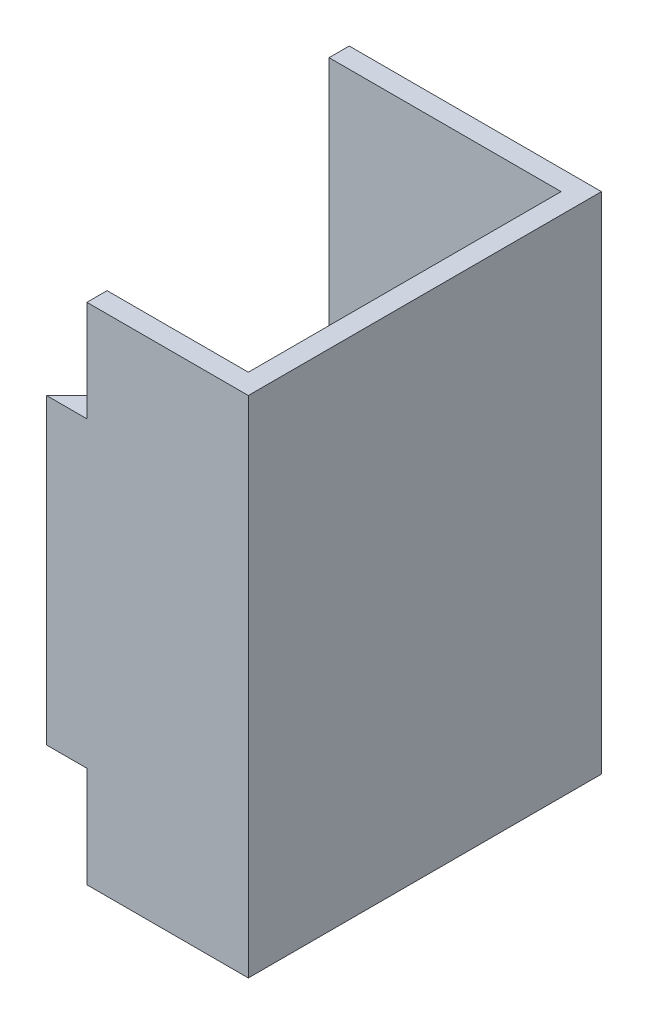
ISO-10303-21;
HEADER;
FILE_DESCRIPTION(('STEP AP214'),'2;1');
FILE_NAME('part.step','',(''),(''),'','','');
FILE_SCHEMA(('AUTOMOTIVE_DESIGN { 1 0 10303 214 1 1 1 1 }'));
ENDSEC;
DATA;
#1=APPLICATION_CONTEXT('core data for automotive mechanical design processes');
#2=APPLICATION_PROTOCOL_DEFINITION('international standard','automotive_design',2000,#1);
#3=PRODUCT_CONTEXT('',#1,'mechanical');
#4=PRODUCT('Part','Part','',(#3));
#5=PRODUCT_RELATED_PRODUCT_CATEGORY('part','',(#4));
#6=PRODUCT_DEFINITION_FORMATION('','',#4);
#7=PRODUCT_DEFINITION_CONTEXT('part definition',#1,'design');
#8=PRODUCT_DEFINITION('design','',#6,#7);
#9=PRODUCT_DEFINITION_SHAPE('','',#8);
#10=(LENGTH_UNIT() NAMED_UNIT(*) SI_UNIT(.MILLI.,.METRE.));
#11=(NAMED_UNIT(*) PLANE_ANGLE_UNIT() SI_UNIT($,.RADIAN.));
#12=(NAMED_UNIT(*) SI_UNIT($,.STERADIAN.) SOLID_ANGLE_UNIT());
#13=UNCERTAINTY_MEASURE_WITH_UNIT(LENGTH_MEASURE(1.E-05),#10,'distance_accuracy_value','');
#14=(GEOMETRIC_REPRESENTATION_CONTEXT(3) GLOBAL_UNCERTAINTY_ASSIGNED_CONTEXT((#13)) GLOBAL_UNIT_ASSIGNED_CONTEXT((#10,
#11,#12)) REPRESENTATION_CONTEXT('',''));
#15=CARTESIAN_POINT('',(0.,0.,0.));
#16=DIRECTION('',(0.,0.,1.));
#17=DIRECTION('',(1.,0.,0.));
#18=AXIS2_PLACEMENT_3D('',#15,#16,#17);
#19=CARTESIAN_POINT('',(0.48,-0.25,0.0199999999999999));
#20=DIRECTION('',(0.,0.,1.));
#21=DIRECTION('',(1.,0.,0.));
#22=AXIS2_PLACEMENT_3D('',#19,#20,#21);
#23=PLANE('',#22);
#24=DIRECTION('',(0.,1.,0.));
#25=VECTOR('',#24,1.);
#26=CARTESIAN_POINT('',(0.48,-0.25,0.0199999999999999));
#27=LINE('',#26,#25);
#28=CARTESIAN_POINT('',(0.48,-0.25,0.0199999999999999));
#29=VERTEX_POINT('',#28);
#30=CARTESIAN_POINT('',(0.48,0.25,0.0199999999999999));
#31=VERTEX_POINT('',#30);
#32=EDGE_CURVE('E11',#29,#31,#27,.T.);
#33=ORIENTED_EDGE('',*,*,#32,.T.);
#34=DIRECTION('',(1.,0.,0.));
#35=VECTOR('',#34,1.);
#36=CARTESIAN_POINT('',(0.48,0.25,0.0199999999999999));
#37=LINE('',#36,#35);
#38=CARTESIAN_POINT('',(0.25,0.25,0.02));
#39=VERTEX_POINT('',#38);
#40=EDGE_CURVE('E24',#39,#31,#37,.T.);
#41=ORIENTED_EDGE('',*,*,#40,.F.);
#42=DIRECTION('',(0.,1.,0.));
#43=VECTOR('',#42,1.);
#44=CARTESIAN_POINT('',(0.25,-0.25,0.02));
#45=LINE('',#44,#43);
#46=CARTESIAN_POINT('',(0.25,-0.25,0.02));
#47=VERTEX_POINT('',#46);
#48=EDGE_CURVE('E203',#47,#39,#45,.T.);
#49=ORIENTED_EDGE('',*,*,#48,.F.);
#50=DIRECTION('',(1.,0.,0.));
#51=VECTOR('',#50,1.);
#52=CARTESIAN_POINT('',(0.48,-0.25,0.0199999999999999));
#53=LINE('',#52,#51);
#54=EDGE_CURVE('E201',#47,#29,#53,.T.);
#55=ORIENTED_EDGE('',*,*,#54,.T.);
#56=EDGE_LOOP('',(#33,#41,#49,#55));
#57=FACE_BOUND('',#56,.T.);
#58=ADVANCED_FACE('F17',(#57),#23,.T.);
#59=CARTESIAN_POINT('',(0.25,-0.25,0.02));
#60=DIRECTION('',(-1.,0.,0.));
#61=DIRECTION('',(0.,0.,1.));
#62=AXIS2_PLACEMENT_3D('',#59,#60,#61);
#63=PLANE('',#62);
#64=ORIENTED_EDGE('',*,*,#48,.T.);
#65=DIRECTION('',(0.,0.,1.));
#66=VECTOR('',#65,1.);
#67=CARTESIAN_POINT('',(0.25,0.25,0.02));
#68=LINE('',#67,#66);
#69=CARTESIAN_POINT('',(0.25,0.25,0.));
#70=VERTEX_POINT('',#69);
#71=EDGE_CURVE('E198',#70,#39,#68,.T.);
#72=ORIENTED_EDGE('',*,*,#71,.F.);
#73=DIRECTION('',(0.,1.,0.));
#74=VECTOR('',#73,1.);
#75=CARTESIAN_POINT('',(0.25,-0.25,0.));
#76=LINE('',#75,#74);
#77=CARTESIAN_POINT('',(0.25,-0.25,0.));
#78=VERTEX_POINT('',#77);
#79=EDGE_CURVE('E195',#78,#70,#76,.T.);
#80=ORIENTED_EDGE('',*,*,#79,.F.);
#81=DIRECTION('',(0.,0.,1.));
#82=VECTOR('',#81,1.);
#83=CARTESIAN_POINT('',(0.25,-0.25,0.02));
#84=LINE('',#83,#82);
#85=EDGE_CURVE('E192',#78,#47,#84,.T.);
#86=ORIENTED_EDGE('',*,*,#85,.T.);
#87=EDGE_LOOP('',(#64,#72,#80,#86));
#88=FACE_BOUND('',#87,.T.);
#89=ADVANCED_FACE('F235',(#88),#63,.T.);
#90=CARTESIAN_POINT('',(0.25,-0.25,0.));
#91=DIRECTION('',(0.,0.,-1.));
#92=DIRECTION('',(-1.,0.,0.));
#93=AXIS2_PLACEMENT_3D('',#90,#91,#92);
#94=PLANE('',#93);
#95=ORIENTED_EDGE('',*,*,#79,.T.);
#96=DIRECTION('',(-1.,0.,0.));
#97=VECTOR('',#96,1.);
#98=CARTESIAN_POINT('',(0.25,0.25,0.));
#99=LINE('',#98,#97);
#100=CARTESIAN_POINT('',(0.5,0.25,0.));
#101=VERTEX_POINT('',#100);
#102=EDGE_CURVE('E189',#101,#70,#99,.T.);
#103=ORIENTED_EDGE('',*,*,#102,.F.);
#104=DIRECTION('',(0.,1.,0.));
#105=VECTOR('',#104,1.);
#106=CARTESIAN_POINT('',(0.5,-0.25,0.));
#107=LINE('',#106,#105);
#108=CARTESIAN_POINT('',(0.5,-0.25,0.));
#109=VERTEX_POINT('',#108);
#110=EDGE_CURVE('E186',#109,#101,#107,.T.);
#111=ORIENTED_EDGE('',*,*,#110,.F.);
#112=DIRECTION('',(-1.,0.,0.));
#113=VECTOR('',#112,1.);
#114=CARTESIAN_POINT('',(0.25,-0.25,0.));
#115=LINE('',#114,#113);
#116=EDGE_CURVE('E183',#109,#78,#115,.T.);
#117=ORIENTED_EDGE('',*,*,#116,.T.);
#118=EDGE_LOOP('',(#95,#103,#111,#117));
#119=FACE_BOUND('',#118,.T.);
#120=ADVANCED_FACE('F232',(#119),#94,.T.);
#121=CARTESIAN_POINT('',(0.5,-0.25,0.));
#122=DIRECTION('',(1.,0.,0.));
#123=DIRECTION('',(0.,0.,-1.));
#124=AXIS2_PLACEMENT_3D('',#121,#122,#123);
#125=PLANE('',#124);
#126=ORIENTED_EDGE('',*,*,#110,.T.);
#127=DIRECTION('',(0.,0.,-1.));
#128=VECTOR('',#127,1.);
#129=CARTESIAN_POINT('',(0.5,0.25,0.));
#130=LINE('',#129,#128);
#131=CARTESIAN_POINT('',(0.5,0.25,0.35));
#132=VERTEX_POINT('',#131);
#133=EDGE_CURVE('E180',#132,#101,#130,.T.);
#134=ORIENTED_EDGE('',*,*,#133,.F.);
#135=DIRECTION('',(0.,1.,0.));
#136=VECTOR('',#135,1.);
#137=CARTESIAN_POINT('',(0.5,-0.25,0.35));
#138=LINE('',#137,#136);
#139=CARTESIAN_POINT('',(0.5,-0.25,0.35));
#140=VERTEX_POINT('',#139);
#141=EDGE_CURVE('E177',#140,#132,#138,.T.);
#142=ORIENTED_EDGE('',*,*,#141,.F.);
#143=DIRECTION('',(0.,0.,-1.));
#144=VECTOR('',#143,1.);
#145=CARTESIAN_POINT('',(0.5,-0.25,0.));
#146=LINE('',#145,#144);
#147=EDGE_CURVE('E174',#140,#109,#146,.T.);
#148=ORIENTED_EDGE('',*,*,#147,.T.);
#149=EDGE_LOOP('',(#126,#134,#142,#148));
#150=FACE_BOUND('',#149,.T.);
#151=ADVANCED_FACE('F230',(#150),#125,.T.);
#152=CARTESIAN_POINT('',(0.5,-0.25,0.35));
#153=DIRECTION('',(0.,0.,1.));
#154=DIRECTION('',(1.,0.,0.));
#155=AXIS2_PLACEMENT_3D('',#152,#153,#154);
#156=PLANE('',#155);
#157=DIRECTION('',(1.,0.,0.));
#158=VECTOR('',#157,1.);
#159=CARTESIAN_POINT('',(0.34,0.15,0.35));
#160=LINE('',#159,#158);
#161=CARTESIAN_POINT('',(0.3,0.15,0.35));
#162=VERTEX_POINT('',#161);
#163=CARTESIAN_POINT('',(0.34,0.15,0.35));
#164=VERTEX_POINT('',#163);
#165=EDGE_CURVE('E172',#162,#164,#160,.T.);
#166=ORIENTED_EDGE('',*,*,#165,.F.);
#167=DIRECTION('',(0.,1.,0.));
#168=VECTOR('',#167,1.);
#169=CARTESIAN_POINT('',(0.3,-0.25,0.35));
#170=LINE('',#169,#168);
#171=CARTESIAN_POINT('',(0.3,-0.15,0.35));
#172=VERTEX_POINT('',#171);
#173=EDGE_CURVE('E169',#172,#162,#170,.T.);
#174=ORIENTED_EDGE('',*,*,#173,.F.);
#175=DIRECTION('',(-1.,0.,0.));
#176=VECTOR('',#175,1.);
#177=CARTESIAN_POINT('',(0.34,-0.15,0.35));
#178=LINE('',#177,#176);
#179=CARTESIAN_POINT('',(0.34,-0.15,0.35));
#180=VERTEX_POINT('',#179);
#181=EDGE_CURVE('E167',#180,#172,#178,.T.);
#182=ORIENTED_EDGE('',*,*,#181,.F.);
#183=DIRECTION('',(0.,1.,0.));
#184=VECTOR('',#183,1.);
#185=CARTESIAN_POINT('',(0.34,-0.25,0.35));
#186=LINE('',#185,#184);
#187=CARTESIAN_POINT('',(0.34,-0.25,0.35));
#188=VERTEX_POINT('',#187);
#189=EDGE_CURVE('E126',#188,#180,#186,.T.);
#190=ORIENTED_EDGE('',*,*,#189,.F.);
#191=DIRECTION('',(1.,0.,0.));
#192=VECTOR('',#191,1.);
#193=CARTESIAN_POINT('',(0.5,-0.25,0.35));
#194=LINE('',#193,#192);
#195=EDGE_CURVE('E163',#188,#140,#194,.T.);
#196=ORIENTED_EDGE('',*,*,#195,.T.);
#197=ORIENTED_EDGE('',*,*,#141,.T.);
#198=DIRECTION('',(1.,0.,0.));
#199=VECTOR('',#198,1.);
#200=CARTESIAN_POINT('',(0.5,0.25,0.35));
#201=LINE('',#200,#199);
#202=CARTESIAN_POINT('',(0.34,0.25,0.35));
#203=VERTEX_POINT('',#202);
#204=EDGE_CURVE('E160',#203,#132,#201,.T.);
#205=ORIENTED_EDGE('',*,*,#204,.F.);
#206=DIRECTION('',(0.,1.,0.));
#207=VECTOR('',#206,1.);
#208=CARTESIAN_POINT('',(0.34,0.25,0.35));
#209=LINE('',#208,#207);
#210=EDGE_CURVE('E157',#164,#203,#209,.T.);
#211=ORIENTED_EDGE('',*,*,#210,.F.);
#212=EDGE_LOOP('',(#166,#174,#182,#190,#196,#197,#205,#211));
#213=FACE_BOUND('',#212,.T.);
#214=ADVANCED_FACE('F216',(#213),#156,.T.);
#215=CARTESIAN_POINT('',(0.3,-0.25,0.35));
#216=DIRECTION('',(-0.707106781186544,0.,-0.707106781186551));
#217=DIRECTION('',(-0.707106781186551,0.,0.707106781186544));
#218=AXIS2_PLACEMENT_3D('',#215,#216,#217);
#219=PLANE('',#218);
#220=DIRECTION('',(0.707106781186551,0.,-0.707106781186544));
#221=VECTOR('',#220,1.);
#222=CARTESIAN_POINT('',(0.4955,0.15,0.154500000000002));
#223=LINE('',#222,#221);
#224=CARTESIAN_POINT('',(0.32,0.15,0.33));
#225=VERTEX_POINT('',#224);
#226=EDGE_CURVE('E155',#162,#225,#223,.T.);
#227=ORIENTED_EDGE('',*,*,#226,.T.);
#228=DIRECTION('',(0.,1.,0.));
#229=VECTOR('',#228,1.);
#230=CARTESIAN_POINT('',(0.32,-0.25,0.33));
#231=LINE('',#230,#229);
#232=CARTESIAN_POINT('',(0.32,-0.15,0.33));
#233=VERTEX_POINT('',#232);
#234=EDGE_CURVE('E153',#233,#225,#231,.T.);
#235=ORIENTED_EDGE('',*,*,#234,.F.);
#236=DIRECTION('',(-0.707106781186551,0.,0.707106781186544));
#237=VECTOR('',#236,1.);
#238=CARTESIAN_POINT('',(0.4955,-0.15,0.154500000000002));
#239=LINE('',#238,#237);
#240=EDGE_CURVE('E121',#233,#172,#239,.T.);
#241=ORIENTED_EDGE('',*,*,#240,.T.);
#242=ORIENTED_EDGE('',*,*,#173,.T.);
#243=EDGE_LOOP('',(#227,#235,#241,#242));
#244=FACE_BOUND('',#243,.T.);
#245=ADVANCED_FACE('F218',(#244),#219,.T.);
#246=CARTESIAN_POINT('',(0.32,-0.25,0.33));
#247=DIRECTION('',(0.,0.,-1.));
#248=DIRECTION('',(-1.,0.,0.));
#249=AXIS2_PLACEMENT_3D('',#246,#247,#248);
#250=PLANE('',#249);
#251=DIRECTION('',(1.,0.,0.));
#252=VECTOR('',#251,1.);
#253=CARTESIAN_POINT('',(0.34,0.15,0.33));
#254=LINE('',#253,#252);
#255=CARTESIAN_POINT('',(0.34,0.15,0.33));
#256=VERTEX_POINT('',#255);
#257=EDGE_CURVE('E150',#225,#256,#254,.T.);
#258=ORIENTED_EDGE('',*,*,#257,.T.);
#259=DIRECTION('',(0.,1.,0.));
#260=VECTOR('',#259,1.);
#261=CARTESIAN_POINT('',(0.34,0.25,0.33));
#262=LINE('',#261,#260);
#263=CARTESIAN_POINT('',(0.34,0.25,0.33));
#264=VERTEX_POINT('',#263);
#265=EDGE_CURVE('E148',#256,#264,#262,.T.);
#266=ORIENTED_EDGE('',*,*,#265,.T.);
#267=DIRECTION('',(-1.,0.,0.));
#268=VECTOR('',#267,1.);
#269=CARTESIAN_POINT('',(0.32,0.25,0.33));
#270=LINE('',#269,#268);
#271=CARTESIAN_POINT('',(0.48,0.25,0.33));
#272=VERTEX_POINT('',#271);
#273=EDGE_CURVE('E145',#272,#264,#270,.T.);
#274=ORIENTED_EDGE('',*,*,#273,.F.);
#275=DIRECTION('',(0.,1.,0.));
#276=VECTOR('',#275,1.);
#277=CARTESIAN_POINT('',(0.48,-0.25,0.33));
#278=LINE('',#277,#276);
#279=CARTESIAN_POINT('',(0.48,-0.25,0.33));
#280=VERTEX_POINT('',#279);
#281=EDGE_CURVE('E142',#280,#272,#278,.T.);
#282=ORIENTED_EDGE('',*,*,#281,.F.);
#283=DIRECTION('',(-1.,0.,0.));
#284=VECTOR('',#283,1.);
#285=CARTESIAN_POINT('',(0.32,-0.25,0.33));
#286=LINE('',#285,#284);
#287=CARTESIAN_POINT('',(0.34,-0.25,0.33));
#288=VERTEX_POINT('',#287);
#289=EDGE_CURVE('E108',#280,#288,#286,.T.);
#290=ORIENTED_EDGE('',*,*,#289,.T.);
#291=DIRECTION('',(0.,1.,0.));
#292=VECTOR('',#291,1.);
#293=CARTESIAN_POINT('',(0.34,-0.25,0.33));
#294=LINE('',#293,#292);
#295=CARTESIAN_POINT('',(0.34,-0.15,0.33));
#296=VERTEX_POINT('',#295);
#297=EDGE_CURVE('E102',#288,#296,#294,.T.);
#298=ORIENTED_EDGE('',*,*,#297,.T.);
#299=DIRECTION('',(-1.,0.,0.));
#300=VECTOR('',#299,1.);
#301=CARTESIAN_POINT('',(0.34,-0.15,0.33));
#302=LINE('',#301,#300);
#303=EDGE_CURVE('E106',#296,#233,#302,.T.);
#304=ORIENTED_EDGE('',*,*,#303,.T.);
#305=ORIENTED_EDGE('',*,*,#234,.T.);
#306=EDGE_LOOP('',(#258,#266,#274,#282,#290,#298,#304,#305));
#307=FACE_BOUND('',#306,.T.);
#308=ADVANCED_FACE('F104',(#307),#250,.T.);
#309=CARTESIAN_POINT('',(0.48,-0.25,0.33));
#310=DIRECTION('',(-1.,0.,0.));
#311=DIRECTION('',(0.,0.,1.));
#312=AXIS2_PLACEMENT_3D('',#309,#310,#311);
#313=PLANE('',#312);
#314=ORIENTED_EDGE('',*,*,#281,.T.);
#315=DIRECTION('',(0.,0.,1.));
#316=VECTOR('',#315,1.);
#317=CARTESIAN_POINT('',(0.48,0.25,0.33));
#318=LINE('',#317,#316);
#319=EDGE_CURVE('E122',#31,#272,#318,.T.);
#320=ORIENTED_EDGE('',*,*,#319,.F.);
#321=ORIENTED_EDGE('',*,*,#32,.F.);
#322=DIRECTION('',(0.,0.,1.));
#323=VECTOR('',#322,1.);
#324=CARTESIAN_POINT('',(0.48,-0.25,0.33));
#325=LINE('',#324,#323);
#326=EDGE_CURVE('E137',#29,#280,#325,.T.);
#327=ORIENTED_EDGE('',*,*,#326,.T.);
#328=EDGE_LOOP('',(#314,#320,#321,#327));
#329=FACE_BOUND('',#328,.T.);
#330=ADVANCED_FACE('F207',(#329),#313,.T.);
#331=CARTESIAN_POINT('',(0.,-0.25,0.));
#332=DIRECTION('',(0.,-1.,0.));
#333=DIRECTION('',(0.,0.,-1.));
#334=AXIS2_PLACEMENT_3D('',#331,#332,#333);
#335=PLANE('',#334);
#336=DIRECTION('',(0.,0.,1.));
#337=VECTOR('',#336,1.);
#338=CARTESIAN_POINT('',(0.34,-0.25,-0.00100000000000013));
#339=LINE('',#338,#337);
#340=EDGE_CURVE('E135',#288,#188,#339,.T.);
#341=ORIENTED_EDGE('',*,*,#340,.F.);
#342=ORIENTED_EDGE('',*,*,#289,.F.);
#343=ORIENTED_EDGE('',*,*,#326,.F.);
#344=ORIENTED_EDGE('',*,*,#54,.F.);
#345=ORIENTED_EDGE('',*,*,#85,.F.);
#346=ORIENTED_EDGE('',*,*,#116,.F.);
#347=ORIENTED_EDGE('',*,*,#147,.F.);
#348=ORIENTED_EDGE('',*,*,#195,.F.);
#349=EDGE_LOOP('',(#341,#342,#343,#344,#345,#346,#347,#348));
#350=FACE_BOUND('',#349,.T.);
#351=ADVANCED_FACE('F210',(#350),#335,.T.);
#352=CARTESIAN_POINT('',(0.,0.25,0.));
#353=DIRECTION('',(0.,-1.,0.));
#354=DIRECTION('',(0.,0.,-1.));
#355=AXIS2_PLACEMENT_3D('',#352,#353,#354);
#356=PLANE('',#355);
#357=ORIENTED_EDGE('',*,*,#273,.T.);
#358=DIRECTION('',(0.,0.,1.));
#359=VECTOR('',#358,1.);
#360=CARTESIAN_POINT('',(0.34,0.25,-0.00100000000000013));
#361=LINE('',#360,#359);
#362=EDGE_CURVE('E130',#264,#203,#361,.T.);
#363=ORIENTED_EDGE('',*,*,#362,.T.);
#364=ORIENTED_EDGE('',*,*,#204,.T.);
#365=ORIENTED_EDGE('',*,*,#133,.T.);
#366=ORIENTED_EDGE('',*,*,#102,.T.);
#367=ORIENTED_EDGE('',*,*,#71,.T.);
#368=ORIENTED_EDGE('',*,*,#40,.T.);
#369=ORIENTED_EDGE('',*,*,#319,.T.);
#370=EDGE_LOOP('',(#357,#363,#364,#365,#366,#367,#368,#369));
#371=FACE_BOUND('',#370,.T.);
#372=ADVANCED_FACE('F206',(#371),#356,.F.);
#373=CARTESIAN_POINT('',(0.34,0.15,-0.00100000000000013));
#374=DIRECTION('',(0.,-1.,0.));
#375=DIRECTION('',(0.,0.,-1.));
#376=AXIS2_PLACEMENT_3D('',#373,#374,#375);
#377=PLANE('',#376);
#378=ORIENTED_EDGE('',*,*,#165,.T.);
#379=DIRECTION('',(0.,0.,1.));
#380=VECTOR('',#379,1.);
#381=CARTESIAN_POINT('',(0.34,0.15,-0.00100000000000013));
#382=LINE('',#381,#380);
#383=EDGE_CURVE('E127',#256,#164,#382,.T.);
#384=ORIENTED_EDGE('',*,*,#383,.F.);
#385=ORIENTED_EDGE('',*,*,#257,.F.);
#386=ORIENTED_EDGE('',*,*,#226,.F.);
#387=EDGE_LOOP('',(#378,#384,#385,#386));
#388=FACE_BOUND('',#387,.T.);
#389=ADVANCED_FACE('F224',(#388),#377,.F.);
#390=CARTESIAN_POINT('',(0.34,0.25,-0.00100000000000013));
#391=DIRECTION('',(1.,0.,0.));
#392=DIRECTION('',(0.,0.,-1.));
#393=AXIS2_PLACEMENT_3D('',#390,#391,#392);
#394=PLANE('',#393);
#395=ORIENTED_EDGE('',*,*,#383,.T.);
#396=ORIENTED_EDGE('',*,*,#210,.T.);
#397=ORIENTED_EDGE('',*,*,#362,.F.);
#398=ORIENTED_EDGE('',*,*,#265,.F.);
#399=EDGE_LOOP('',(#395,#396,#397,#398));
#400=FACE_BOUND('',#399,.T.);
#401=ADVANCED_FACE('F227',(#400),#394,.F.);
#402=CARTESIAN_POINT('',(0.34,-0.25,-0.00100000000000013));
#403=DIRECTION('',(1.,0.,0.));
#404=DIRECTION('',(0.,0.,-1.));
#405=AXIS2_PLACEMENT_3D('',#402,#403,#404);
#406=PLANE('',#405);
#407=ORIENTED_EDGE('',*,*,#340,.T.);
#408=ORIENTED_EDGE('',*,*,#189,.T.);
#409=DIRECTION('',(0.,0.,1.));
#410=VECTOR('',#409,1.);
#411=CARTESIAN_POINT('',(0.34,-0.15,-0.00100000000000013));
#412=LINE('',#411,#410);
#413=EDGE_CURVE('E119',#296,#180,#412,.T.);
#414=ORIENTED_EDGE('',*,*,#413,.F.);
#415=ORIENTED_EDGE('',*,*,#297,.F.);
#416=EDGE_LOOP('',(#407,#408,#414,#415));
#417=FACE_BOUND('',#416,.T.);
#418=ADVANCED_FACE('F125',(#417),#406,.F.);
#419=CARTESIAN_POINT('',(0.34,-0.15,-0.00100000000000013));
#420=DIRECTION('',(0.,1.,0.));
#421=DIRECTION('',(0.,0.,1.));
#422=AXIS2_PLACEMENT_3D('',#419,#420,#421);
#423=PLANE('',#422);
#424=ORIENTED_EDGE('',*,*,#303,.F.);
#425=ORIENTED_EDGE('',*,*,#413,.T.);
#426=ORIENTED_EDGE('',*,*,#181,.T.);
#427=ORIENTED_EDGE('',*,*,#240,.F.);
#428=EDGE_LOOP('',(#424,#425,#426,#427));
#429=FACE_BOUND('',#428,.T.);
#430=ADVANCED_FACE('F117',(#429),#423,.F.);
#431=CLOSED_SHELL('',(#58,#89,#120,#151,#214,#245,#308,#330,#351,#372,#389,#401,#418,#430));
#432=MANIFOLD_SOLID_BREP('B1',#431);
#433=ADVANCED_BREP_SHAPE_REPRESENTATION('',(#18,#432),#14);
#434=SHAPE_DEFINITION_REPRESENTATION(#9,#433);
ENDSEC;
END-ISO-10303-21;
